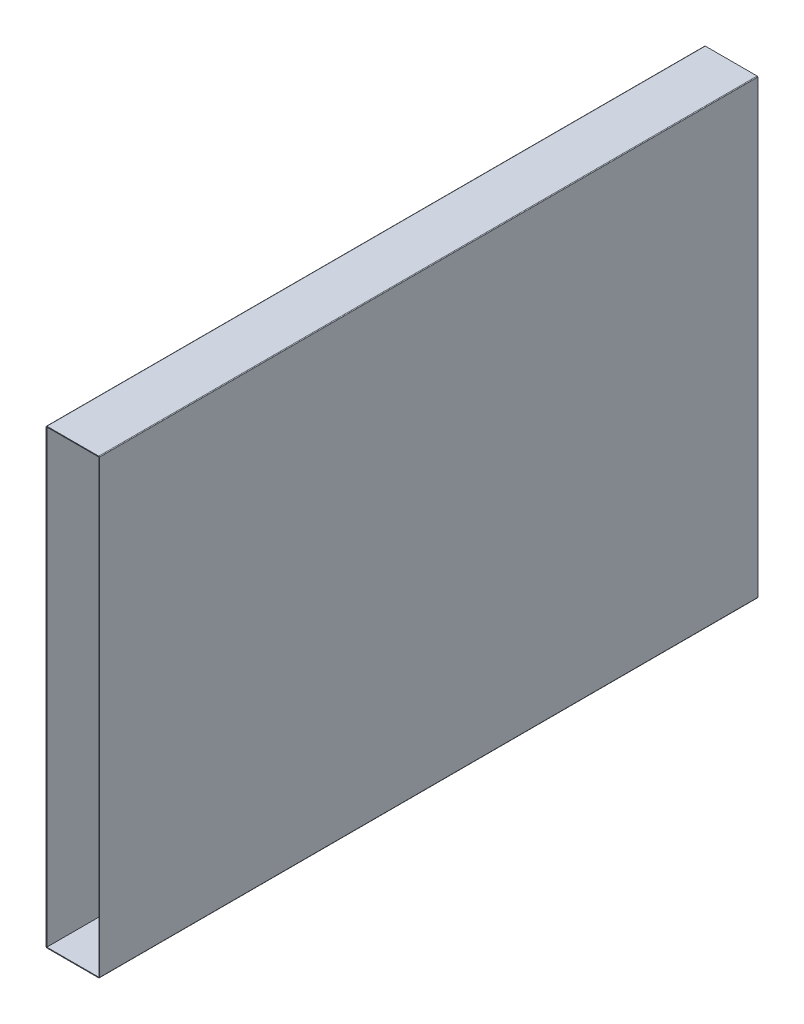
ISO-10303-21;
HEADER;
FILE_DESCRIPTION(('STEP AP214'),'2;1');
FILE_NAME('part.step','',(''),(''),'','','');
FILE_SCHEMA(('AUTOMOTIVE_DESIGN { 1 0 10303 214 1 1 1 1 }'));
ENDSEC;
DATA;
#1=APPLICATION_CONTEXT('core data for automotive mechanical design processes');
#2=APPLICATION_PROTOCOL_DEFINITION('international standard','automotive_design',2000,#1);
#3=PRODUCT_CONTEXT('',#1,'mechanical');
#4=PRODUCT('Part','Part','',(#3));
#5=PRODUCT_RELATED_PRODUCT_CATEGORY('part','',(#4));
#6=PRODUCT_DEFINITION_FORMATION('','',#4);
#7=PRODUCT_DEFINITION_CONTEXT('part definition',#1,'design');
#8=PRODUCT_DEFINITION('design','',#6,#7);
#9=PRODUCT_DEFINITION_SHAPE('','',#8);
#10=(LENGTH_UNIT() NAMED_UNIT(*) SI_UNIT(.MILLI.,.METRE.));
#11=(NAMED_UNIT(*) PLANE_ANGLE_UNIT() SI_UNIT($,.RADIAN.));
#12=(NAMED_UNIT(*) SI_UNIT($,.STERADIAN.) SOLID_ANGLE_UNIT());
#13=UNCERTAINTY_MEASURE_WITH_UNIT(LENGTH_MEASURE(1.E-05),#10,'distance_accuracy_value','');
#14=(GEOMETRIC_REPRESENTATION_CONTEXT(3) GLOBAL_UNCERTAINTY_ASSIGNED_CONTEXT((#13)) GLOBAL_UNIT_ASSIGNED_CONTEXT((#10,
#11,#12)) REPRESENTATION_CONTEXT('',''));
#15=CARTESIAN_POINT('',(0.,0.,0.));
#16=DIRECTION('',(0.,0.,1.));
#17=DIRECTION('',(1.,0.,0.));
#18=AXIS2_PLACEMENT_3D('',#15,#16,#17);
#19=CARTESIAN_POINT('',(197.463522888188,-69.3567160730855,190.));
#20=DIRECTION('',(0.,0.,1.));
#21=DIRECTION('',(1.,0.,0.));
#22=AXIS2_PLACEMENT_3D('',#19,#20,#21);
#23=PLANE('',#22);
#24=CARTESIAN_POINT('',(197.463522888188,-69.3567160730855,190.));
#25=DIRECTION('',(0.,0.,1.));
#26=DIRECTION('',(1.,0.,0.));
#27=AXIS2_PLACEMENT_3D('',#24,#25,#26);
#28=CIRCLE('',#27,0.200000000000006);
#29=CARTESIAN_POINT('',(197.463522888188,-69.5567160730855,190.));
#30=VERTEX_POINT('',#29);
#31=CARTESIAN_POINT('',(197.663522888188,-69.3567160730855,190.));
#32=VERTEX_POINT('',#31);
#33=EDGE_CURVE('E158',#30,#32,#28,.T.);
#34=ORIENTED_EDGE('',*,*,#33,.T.);
#35=DIRECTION('',(0.,1.,0.));
#36=VECTOR('',#35,1.);
#37=CARTESIAN_POINT('',(197.663522888188,-69.3567160730855,190.));
#38=LINE('',#37,#36);
#39=CARTESIAN_POINT('',(197.663522888188,60.6460936268564,190.));
#40=VERTEX_POINT('',#39);
#41=EDGE_CURVE('E161',#32,#40,#38,.T.);
#42=ORIENTED_EDGE('',*,*,#41,.T.);
#43=CARTESIAN_POINT('',(197.463522888188,60.6460936268564,190.));
#44=DIRECTION('',(0.,0.,1.));
#45=DIRECTION('',(-1.,0.,0.));
#46=AXIS2_PLACEMENT_3D('',#43,#44,#45);
#47=CIRCLE('',#46,0.200000000000002);
#48=CARTESIAN_POINT('',(197.463522888188,60.8460936268564,190.));
#49=VERTEX_POINT('',#48);
#50=EDGE_CURVE('E164',#40,#49,#47,.T.);
#51=ORIENTED_EDGE('',*,*,#50,.T.);
#52=DIRECTION('',(-1.,0.,0.));
#53=VECTOR('',#52,1.);
#54=CARTESIAN_POINT('',(182.536477111812,60.8460936268564,190.));
#55=LINE('',#54,#53);
#56=CARTESIAN_POINT('',(182.536477111812,60.8460936268564,190.));
#57=VERTEX_POINT('',#56);
#58=EDGE_CURVE('E166',#49,#57,#55,.T.);
#59=ORIENTED_EDGE('',*,*,#58,.T.);
#60=CARTESIAN_POINT('',(182.536477111812,60.6460936268564,190.));
#61=DIRECTION('',(0.,0.,1.));
#62=DIRECTION('',(-1.,0.,0.));
#63=AXIS2_PLACEMENT_3D('',#60,#61,#62);
#64=CIRCLE('',#63,0.200000000000002);
#65=CARTESIAN_POINT('',(182.336477111812,60.6460936268564,190.));
#66=VERTEX_POINT('',#65);
#67=EDGE_CURVE('E168',#57,#66,#64,.T.);
#68=ORIENTED_EDGE('',*,*,#67,.T.);
#69=DIRECTION('',(0.,-1.,0.));
#70=VECTOR('',#69,1.);
#71=CARTESIAN_POINT('',(182.336477111812,-69.3567160730855,190.));
#72=LINE('',#71,#70);
#73=CARTESIAN_POINT('',(182.336477111812,-69.3567160730855,190.));
#74=VERTEX_POINT('',#73);
#75=EDGE_CURVE('E170',#66,#74,#72,.T.);
#76=ORIENTED_EDGE('',*,*,#75,.T.);
#77=CARTESIAN_POINT('',(182.536477111812,-69.3567160730855,190.));
#78=DIRECTION('',(0.,0.,1.));
#79=DIRECTION('',(-1.,0.,0.));
#80=AXIS2_PLACEMENT_3D('',#77,#78,#79);
#81=CIRCLE('',#80,0.200000000000006);
#82=CARTESIAN_POINT('',(182.536477111812,-69.5567160730855,190.));
#83=VERTEX_POINT('',#82);
#84=EDGE_CURVE('E172',#74,#83,#81,.T.);
#85=ORIENTED_EDGE('',*,*,#84,.T.);
#86=DIRECTION('',(1.,0.,0.));
#87=VECTOR('',#86,1.);
#88=CARTESIAN_POINT('',(182.536477111812,-69.5567160730855,190.));
#89=LINE('',#88,#87);
#90=EDGE_CURVE('E174',#83,#30,#89,.T.);
#91=ORIENTED_EDGE('',*,*,#90,.T.);
#92=EDGE_LOOP('',(#34,#42,#51,#59,#68,#76,#85,#91));
#93=FACE_BOUND('',#92,.T.);
#94=DIRECTION('',(1.,0.,0.));
#95=VECTOR('',#94,1.);
#96=CARTESIAN_POINT('',(182.5,-69.3553112231146,190.));
#97=LINE('',#96,#95);
#98=CARTESIAN_POINT('',(182.5,-69.3553112231146,190.));
#99=VERTEX_POINT('',#98);
#100=CARTESIAN_POINT('',(197.5,-69.3553112231146,190.));
#101=VERTEX_POINT('',#100);
#102=EDGE_CURVE('E130',#99,#101,#97,.T.);
#103=ORIENTED_EDGE('',*,*,#102,.F.);
#104=DIRECTION('',(0.,-1.,0.));
#105=VECTOR('',#104,1.);
#106=CARTESIAN_POINT('',(182.5,60.6446887768854,190.));
#107=LINE('',#106,#105);
#108=CARTESIAN_POINT('',(182.5,60.6446887768854,190.));
#109=VERTEX_POINT('',#108);
#110=EDGE_CURVE('E122',#109,#99,#107,.T.);
#111=ORIENTED_EDGE('',*,*,#110,.F.);
#112=DIRECTION('',(-1.,0.,0.));
#113=VECTOR('',#112,1.);
#114=CARTESIAN_POINT('',(182.5,60.6446887768854,190.));
#115=LINE('',#114,#113);
#116=CARTESIAN_POINT('',(197.5,60.6446887768854,190.));
#117=VERTEX_POINT('',#116);
#118=EDGE_CURVE('E144',#117,#109,#115,.T.);
#119=ORIENTED_EDGE('',*,*,#118,.F.);
#120=DIRECTION('',(0.,1.,0.));
#121=VECTOR('',#120,1.);
#122=CARTESIAN_POINT('',(197.5,60.6446887768854,190.));
#123=LINE('',#122,#121);
#124=EDGE_CURVE('E142',#101,#117,#123,.T.);
#125=ORIENTED_EDGE('',*,*,#124,.F.);
#126=EDGE_LOOP('',(#103,#111,#119,#125));
#127=FACE_BOUND('',#126,.T.);
#128=ADVANCED_FACE('F33',(#93,#127),#23,.T.);
#129=CARTESIAN_POINT('',(197.463522888188,-69.3567160730855,0.));
#130=DIRECTION('',(0.,0.,1.));
#131=DIRECTION('',(1.,0.,0.));
#132=AXIS2_PLACEMENT_3D('',#129,#130,#131);
#133=PLANE('',#132);
#134=CARTESIAN_POINT('',(197.463522888188,-69.3567160730855,0.));
#135=DIRECTION('',(0.,0.,1.));
#136=DIRECTION('',(1.,0.,0.));
#137=AXIS2_PLACEMENT_3D('',#134,#135,#136);
#138=CIRCLE('',#137,0.200000000000006);
#139=CARTESIAN_POINT('',(197.463522888188,-69.5567160730855,0.));
#140=VERTEX_POINT('',#139);
#141=CARTESIAN_POINT('',(197.663522888188,-69.3567160730855,0.));
#142=VERTEX_POINT('',#141);
#143=EDGE_CURVE('E138',#140,#142,#138,.T.);
#144=ORIENTED_EDGE('',*,*,#143,.F.);
#145=DIRECTION('',(1.,0.,0.));
#146=VECTOR('',#145,1.);
#147=CARTESIAN_POINT('',(182.536477111812,-69.5567160730855,0.));
#148=LINE('',#147,#146);
#149=CARTESIAN_POINT('',(182.536477111812,-69.5567160730855,0.));
#150=VERTEX_POINT('',#149);
#151=EDGE_CURVE('E162',#150,#140,#148,.T.);
#152=ORIENTED_EDGE('',*,*,#151,.F.);
#153=CARTESIAN_POINT('',(182.536477111812,-69.3567160730855,0.));
#154=DIRECTION('',(0.,0.,1.));
#155=DIRECTION('',(-1.,0.,0.));
#156=AXIS2_PLACEMENT_3D('',#153,#154,#155);
#157=CIRCLE('',#156,0.200000000000006);
#158=CARTESIAN_POINT('',(182.336477111812,-69.3567160730855,0.));
#159=VERTEX_POINT('',#158);
#160=EDGE_CURVE('E189',#159,#150,#157,.T.);
#161=ORIENTED_EDGE('',*,*,#160,.F.);
#162=DIRECTION('',(0.,-1.,0.));
#163=VECTOR('',#162,1.);
#164=CARTESIAN_POINT('',(182.336477111812,-69.3567160730855,0.));
#165=LINE('',#164,#163);
#166=CARTESIAN_POINT('',(182.336477111812,60.6460936268564,0.));
#167=VERTEX_POINT('',#166);
#168=EDGE_CURVE('E187',#167,#159,#165,.T.);
#169=ORIENTED_EDGE('',*,*,#168,.F.);
#170=CARTESIAN_POINT('',(182.536477111812,60.6460936268564,0.));
#171=DIRECTION('',(0.,0.,1.));
#172=DIRECTION('',(-1.,0.,0.));
#173=AXIS2_PLACEMENT_3D('',#170,#171,#172);
#174=CIRCLE('',#173,0.200000000000002);
#175=CARTESIAN_POINT('',(182.536477111812,60.8460936268564,0.));
#176=VERTEX_POINT('',#175);
#177=EDGE_CURVE('E185',#176,#167,#174,.T.);
#178=ORIENTED_EDGE('',*,*,#177,.F.);
#179=DIRECTION('',(-1.,0.,0.));
#180=VECTOR('',#179,1.);
#181=CARTESIAN_POINT('',(182.536477111812,60.8460936268564,0.));
#182=LINE('',#181,#180);
#183=CARTESIAN_POINT('',(197.463522888188,60.8460936268564,0.));
#184=VERTEX_POINT('',#183);
#185=EDGE_CURVE('E183',#184,#176,#182,.T.);
#186=ORIENTED_EDGE('',*,*,#185,.F.);
#187=CARTESIAN_POINT('',(197.463522888188,60.6460936268564,0.));
#188=DIRECTION('',(0.,0.,1.));
#189=DIRECTION('',(-1.,0.,0.));
#190=AXIS2_PLACEMENT_3D('',#187,#188,#189);
#191=CIRCLE('',#190,0.200000000000002);
#192=CARTESIAN_POINT('',(197.663522888188,60.6460936268564,0.));
#193=VERTEX_POINT('',#192);
#194=EDGE_CURVE('E181',#193,#184,#191,.T.);
#195=ORIENTED_EDGE('',*,*,#194,.F.);
#196=DIRECTION('',(0.,1.,0.));
#197=VECTOR('',#196,1.);
#198=CARTESIAN_POINT('',(197.663522888188,-69.3567160730855,0.));
#199=LINE('',#198,#197);
#200=EDGE_CURVE('E179',#142,#193,#199,.T.);
#201=ORIENTED_EDGE('',*,*,#200,.F.);
#202=EDGE_LOOP('',(#144,#152,#161,#169,#178,#186,#195,#201));
#203=FACE_BOUND('',#202,.T.);
#204=DIRECTION('',(0.,-1.,0.));
#205=VECTOR('',#204,1.);
#206=CARTESIAN_POINT('',(182.5,60.6446887768854,0.));
#207=LINE('',#206,#205);
#208=CARTESIAN_POINT('',(182.5,60.6446887768854,0.));
#209=VERTEX_POINT('',#208);
#210=CARTESIAN_POINT('',(182.5,-69.3553112231146,0.));
#211=VERTEX_POINT('',#210);
#212=EDGE_CURVE('E56',#209,#211,#207,.T.);
#213=ORIENTED_EDGE('',*,*,#212,.T.);
#214=DIRECTION('',(1.,0.,0.));
#215=VECTOR('',#214,1.);
#216=CARTESIAN_POINT('',(182.5,-69.3553112231146,0.));
#217=LINE('',#216,#215);
#218=CARTESIAN_POINT('',(197.5,-69.3553112231146,0.));
#219=VERTEX_POINT('',#218);
#220=EDGE_CURVE('E137',#211,#219,#217,.T.);
#221=ORIENTED_EDGE('',*,*,#220,.T.);
#222=DIRECTION('',(0.,1.,0.));
#223=VECTOR('',#222,1.);
#224=CARTESIAN_POINT('',(197.5,60.6446887768854,0.));
#225=LINE('',#224,#223);
#226=CARTESIAN_POINT('',(197.5,60.6446887768854,0.));
#227=VERTEX_POINT('',#226);
#228=EDGE_CURVE('E150',#219,#227,#225,.T.);
#229=ORIENTED_EDGE('',*,*,#228,.T.);
#230=DIRECTION('',(-1.,0.,0.));
#231=VECTOR('',#230,1.);
#232=CARTESIAN_POINT('',(182.5,60.6446887768854,0.));
#233=LINE('',#232,#231);
#234=EDGE_CURVE('E131',#227,#209,#233,.T.);
#235=ORIENTED_EDGE('',*,*,#234,.T.);
#236=EDGE_LOOP('',(#213,#221,#229,#235));
#237=FACE_BOUND('',#236,.T.);
#238=ADVANCED_FACE('F219',(#203,#237),#133,.F.);
#239=CARTESIAN_POINT('',(197.463522888188,-69.3567160730855,190.));
#240=DIRECTION('',(0.,0.,-1.));
#241=DIRECTION('',(-1.,0.,0.));
#242=AXIS2_PLACEMENT_3D('',#239,#240,#241);
#243=CYLINDRICAL_SURFACE('',#242,0.200000000000006);
#244=ORIENTED_EDGE('',*,*,#143,.T.);
#245=DIRECTION('',(0.,0.,-1.));
#246=VECTOR('',#245,1.);
#247=CARTESIAN_POINT('',(197.663522888188,-69.3567160730855,190.));
#248=LINE('',#247,#246);
#249=EDGE_CURVE('E11',#32,#142,#248,.T.);
#250=ORIENTED_EDGE('',*,*,#249,.F.);
#251=ORIENTED_EDGE('',*,*,#33,.F.);
#252=DIRECTION('',(0.,0.,-1.));
#253=VECTOR('',#252,1.);
#254=CARTESIAN_POINT('',(197.463522888188,-69.5567160730855,190.));
#255=LINE('',#254,#253);
#256=EDGE_CURVE('E176',#30,#140,#255,.T.);
#257=ORIENTED_EDGE('',*,*,#256,.T.);
#258=EDGE_LOOP('',(#244,#250,#251,#257));
#259=FACE_BOUND('',#258,.T.);
#260=ADVANCED_FACE('F35',(#259),#243,.T.);
#261=CARTESIAN_POINT('',(197.663522888188,-69.3567160730855,190.));
#262=DIRECTION('',(-1.,0.,0.));
#263=DIRECTION('',(0.,0.,1.));
#264=AXIS2_PLACEMENT_3D('',#261,#262,#263);
#265=PLANE('',#264);
#266=ORIENTED_EDGE('',*,*,#200,.T.);
#267=DIRECTION('',(0.,0.,-1.));
#268=VECTOR('',#267,1.);
#269=CARTESIAN_POINT('',(197.663522888188,60.6460936268564,190.));
#270=LINE('',#269,#268);
#271=EDGE_CURVE('E41',#40,#193,#270,.T.);
#272=ORIENTED_EDGE('',*,*,#271,.F.);
#273=ORIENTED_EDGE('',*,*,#41,.F.);
#274=ORIENTED_EDGE('',*,*,#249,.T.);
#275=EDGE_LOOP('',(#266,#272,#273,#274));
#276=FACE_BOUND('',#275,.T.);
#277=ADVANCED_FACE('F236',(#276),#265,.F.);
#278=CARTESIAN_POINT('',(197.463522888188,60.6460936268564,190.));
#279=DIRECTION('',(0.,0.,-1.));
#280=DIRECTION('',(-1.,0.,0.));
#281=AXIS2_PLACEMENT_3D('',#278,#279,#280);
#282=CYLINDRICAL_SURFACE('',#281,0.200000000000002);
#283=ORIENTED_EDGE('',*,*,#194,.T.);
#284=DIRECTION('',(0.,0.,-1.));
#285=VECTOR('',#284,1.);
#286=CARTESIAN_POINT('',(197.463522888188,60.8460936268564,190.));
#287=LINE('',#286,#285);
#288=EDGE_CURVE('E206',#49,#184,#287,.T.);
#289=ORIENTED_EDGE('',*,*,#288,.F.);
#290=ORIENTED_EDGE('',*,*,#50,.F.);
#291=ORIENTED_EDGE('',*,*,#271,.T.);
#292=EDGE_LOOP('',(#283,#289,#290,#291));
#293=FACE_BOUND('',#292,.T.);
#294=ADVANCED_FACE('F213',(#293),#282,.T.);
#295=CARTESIAN_POINT('',(182.536477111812,60.8460936268564,190.));
#296=DIRECTION('',(0.,-1.,0.));
#297=DIRECTION('',(0.,0.,-1.));
#298=AXIS2_PLACEMENT_3D('',#295,#296,#297);
#299=PLANE('',#298);
#300=ORIENTED_EDGE('',*,*,#185,.T.);
#301=DIRECTION('',(0.,0.,-1.));
#302=VECTOR('',#301,1.);
#303=CARTESIAN_POINT('',(182.536477111812,60.8460936268564,190.));
#304=LINE('',#303,#302);
#305=EDGE_CURVE('E203',#57,#176,#304,.T.);
#306=ORIENTED_EDGE('',*,*,#305,.F.);
#307=ORIENTED_EDGE('',*,*,#58,.F.);
#308=ORIENTED_EDGE('',*,*,#288,.T.);
#309=EDGE_LOOP('',(#300,#306,#307,#308));
#310=FACE_BOUND('',#309,.T.);
#311=ADVANCED_FACE('F225',(#310),#299,.F.);
#312=CARTESIAN_POINT('',(182.536477111812,60.6460936268564,190.));
#313=DIRECTION('',(0.,0.,-1.));
#314=DIRECTION('',(-1.,0.,0.));
#315=AXIS2_PLACEMENT_3D('',#312,#313,#314);
#316=CYLINDRICAL_SURFACE('',#315,0.200000000000002);
#317=ORIENTED_EDGE('',*,*,#177,.T.);
#318=DIRECTION('',(0.,0.,-1.));
#319=VECTOR('',#318,1.);
#320=CARTESIAN_POINT('',(182.336477111812,60.6460936268564,190.));
#321=LINE('',#320,#319);
#322=EDGE_CURVE('E200',#66,#167,#321,.T.);
#323=ORIENTED_EDGE('',*,*,#322,.F.);
#324=ORIENTED_EDGE('',*,*,#67,.F.);
#325=ORIENTED_EDGE('',*,*,#305,.T.);
#326=EDGE_LOOP('',(#317,#323,#324,#325));
#327=FACE_BOUND('',#326,.T.);
#328=ADVANCED_FACE('F229',(#327),#316,.T.);
#329=CARTESIAN_POINT('',(182.336477111812,-69.3567160730855,190.));
#330=DIRECTION('',(1.,0.,0.));
#331=DIRECTION('',(0.,0.,-1.));
#332=AXIS2_PLACEMENT_3D('',#329,#330,#331);
#333=PLANE('',#332);
#334=ORIENTED_EDGE('',*,*,#168,.T.);
#335=DIRECTION('',(0.,0.,-1.));
#336=VECTOR('',#335,1.);
#337=CARTESIAN_POINT('',(182.336477111812,-69.3567160730855,190.));
#338=LINE('',#337,#336);
#339=EDGE_CURVE('E197',#74,#159,#338,.T.);
#340=ORIENTED_EDGE('',*,*,#339,.F.);
#341=ORIENTED_EDGE('',*,*,#75,.F.);
#342=ORIENTED_EDGE('',*,*,#322,.T.);
#343=EDGE_LOOP('',(#334,#340,#341,#342));
#344=FACE_BOUND('',#343,.T.);
#345=ADVANCED_FACE('F249',(#344),#333,.F.);
#346=CARTESIAN_POINT('',(182.536477111812,-69.3567160730855,190.));
#347=DIRECTION('',(0.,0.,-1.));
#348=DIRECTION('',(-1.,0.,0.));
#349=AXIS2_PLACEMENT_3D('',#346,#347,#348);
#350=CYLINDRICAL_SURFACE('',#349,0.200000000000006);
#351=ORIENTED_EDGE('',*,*,#160,.T.);
#352=DIRECTION('',(0.,0.,-1.));
#353=VECTOR('',#352,1.);
#354=CARTESIAN_POINT('',(182.536477111812,-69.5567160730855,190.));
#355=LINE('',#354,#353);
#356=EDGE_CURVE('E194',#83,#150,#355,.T.);
#357=ORIENTED_EDGE('',*,*,#356,.F.);
#358=ORIENTED_EDGE('',*,*,#84,.F.);
#359=ORIENTED_EDGE('',*,*,#339,.T.);
#360=EDGE_LOOP('',(#351,#357,#358,#359));
#361=FACE_BOUND('',#360,.T.);
#362=ADVANCED_FACE('F247',(#361),#350,.T.);
#363=CARTESIAN_POINT('',(182.536477111812,-69.5567160730855,190.));
#364=DIRECTION('',(0.,1.,0.));
#365=DIRECTION('',(0.,0.,1.));
#366=AXIS2_PLACEMENT_3D('',#363,#364,#365);
#367=PLANE('',#366);
#368=ORIENTED_EDGE('',*,*,#151,.T.);
#369=ORIENTED_EDGE('',*,*,#256,.F.);
#370=ORIENTED_EDGE('',*,*,#90,.F.);
#371=ORIENTED_EDGE('',*,*,#356,.T.);
#372=EDGE_LOOP('',(#368,#369,#370,#371));
#373=FACE_BOUND('',#372,.T.);
#374=ADVANCED_FACE('F242',(#373),#367,.F.);
#375=CARTESIAN_POINT('',(182.5,60.6446887768854,190.));
#376=DIRECTION('',(1.,0.,0.));
#377=DIRECTION('',(0.,0.,-1.));
#378=AXIS2_PLACEMENT_3D('',#375,#376,#377);
#379=PLANE('',#378);
#380=ORIENTED_EDGE('',*,*,#212,.F.);
#381=DIRECTION('',(0.,0.,-1.));
#382=VECTOR('',#381,1.);
#383=CARTESIAN_POINT('',(182.5,60.6446887768854,190.));
#384=LINE('',#383,#382);
#385=EDGE_CURVE('E126',#109,#209,#384,.T.);
#386=ORIENTED_EDGE('',*,*,#385,.F.);
#387=ORIENTED_EDGE('',*,*,#110,.T.);
#388=DIRECTION('',(0.,0.,-1.));
#389=VECTOR('',#388,1.);
#390=CARTESIAN_POINT('',(182.5,-69.3553112231146,190.));
#391=LINE('',#390,#389);
#392=EDGE_CURVE('E125',#99,#211,#391,.T.);
#393=ORIENTED_EDGE('',*,*,#392,.T.);
#394=EDGE_LOOP('',(#380,#386,#387,#393));
#395=FACE_BOUND('',#394,.T.);
#396=ADVANCED_FACE('F124',(#395),#379,.T.);
#397=CARTESIAN_POINT('',(182.5,-69.3553112231146,190.));
#398=DIRECTION('',(0.,1.,0.));
#399=DIRECTION('',(0.,0.,1.));
#400=AXIS2_PLACEMENT_3D('',#397,#398,#399);
#401=PLANE('',#400);
#402=ORIENTED_EDGE('',*,*,#220,.F.);
#403=ORIENTED_EDGE('',*,*,#392,.F.);
#404=ORIENTED_EDGE('',*,*,#102,.T.);
#405=DIRECTION('',(0.,0.,-1.));
#406=VECTOR('',#405,1.);
#407=CARTESIAN_POINT('',(197.5,-69.3553112231146,190.));
#408=LINE('',#407,#406);
#409=EDGE_CURVE('E139',#101,#219,#408,.T.);
#410=ORIENTED_EDGE('',*,*,#409,.T.);
#411=EDGE_LOOP('',(#402,#403,#404,#410));
#412=FACE_BOUND('',#411,.T.);
#413=ADVANCED_FACE('F134',(#412),#401,.T.);
#414=CARTESIAN_POINT('',(197.5,60.6446887768854,190.));
#415=DIRECTION('',(-1.,0.,0.));
#416=DIRECTION('',(0.,0.,1.));
#417=AXIS2_PLACEMENT_3D('',#414,#415,#416);
#418=PLANE('',#417);
#419=ORIENTED_EDGE('',*,*,#228,.F.);
#420=ORIENTED_EDGE('',*,*,#409,.F.);
#421=ORIENTED_EDGE('',*,*,#124,.T.);
#422=DIRECTION('',(0.,0.,-1.));
#423=VECTOR('',#422,1.);
#424=CARTESIAN_POINT('',(197.5,60.6446887768854,190.));
#425=LINE('',#424,#423);
#426=EDGE_CURVE('E48',#117,#227,#425,.T.);
#427=ORIENTED_EDGE('',*,*,#426,.T.);
#428=EDGE_LOOP('',(#419,#420,#421,#427));
#429=FACE_BOUND('',#428,.T.);
#430=ADVANCED_FACE('F274',(#429),#418,.T.);
#431=CARTESIAN_POINT('',(182.5,60.6446887768854,190.));
#432=DIRECTION('',(0.,-1.,0.));
#433=DIRECTION('',(0.,0.,-1.));
#434=AXIS2_PLACEMENT_3D('',#431,#432,#433);
#435=PLANE('',#434);
#436=ORIENTED_EDGE('',*,*,#234,.F.);
#437=ORIENTED_EDGE('',*,*,#426,.F.);
#438=ORIENTED_EDGE('',*,*,#118,.T.);
#439=ORIENTED_EDGE('',*,*,#385,.T.);
#440=EDGE_LOOP('',(#436,#437,#438,#439));
#441=FACE_BOUND('',#440,.T.);
#442=ADVANCED_FACE('F278',(#441),#435,.T.);
#443=CLOSED_SHELL('',(#128,#238,#260,#277,#294,#311,#328,#345,#362,#374,#396,#413,#430,#442));
#444=MANIFOLD_SOLID_BREP('B2',#443);
#445=ADVANCED_BREP_SHAPE_REPRESENTATION('',(#18,#444),#14);
#446=SHAPE_DEFINITION_REPRESENTATION(#9,#445);
ENDSEC;
END-ISO-10303-21;
